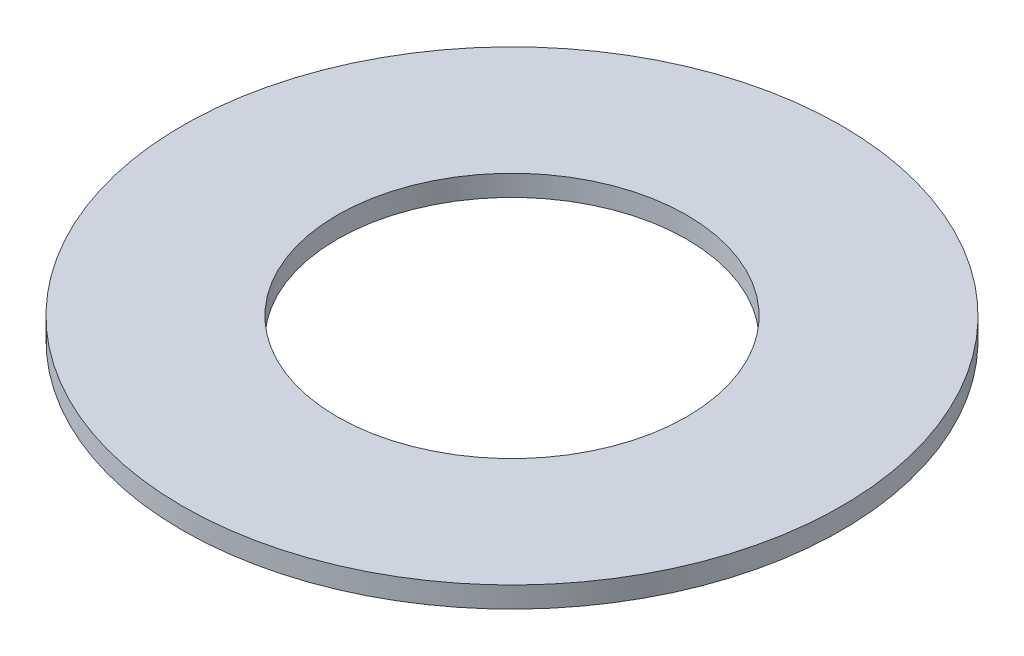
ISO-10303-21;
HEADER;
FILE_DESCRIPTION(('STEP AP214'),'2;1');
FILE_NAME('part.step','',(''),(''),'','','');
FILE_SCHEMA(('AUTOMOTIVE_DESIGN { 1 0 10303 214 1 1 1 1 }'));
ENDSEC;
DATA;
#1=APPLICATION_CONTEXT('core data for automotive mechanical design processes');
#2=APPLICATION_PROTOCOL_DEFINITION('international standard','automotive_design',2000,#1);
#3=PRODUCT_CONTEXT('',#1,'mechanical');
#4=PRODUCT('Part','Part','',(#3));
#5=PRODUCT_RELATED_PRODUCT_CATEGORY('part','',(#4));
#6=PRODUCT_DEFINITION_FORMATION('','',#4);
#7=PRODUCT_DEFINITION_CONTEXT('part definition',#1,'design');
#8=PRODUCT_DEFINITION('design','',#6,#7);
#9=PRODUCT_DEFINITION_SHAPE('','',#8);
#10=(LENGTH_UNIT() NAMED_UNIT(*) SI_UNIT(.MILLI.,.METRE.));
#11=(NAMED_UNIT(*) PLANE_ANGLE_UNIT() SI_UNIT($,.RADIAN.));
#12=(NAMED_UNIT(*) SI_UNIT($,.STERADIAN.) SOLID_ANGLE_UNIT());
#13=UNCERTAINTY_MEASURE_WITH_UNIT(LENGTH_MEASURE(1.E-05),#10,'distance_accuracy_value','');
#14=(GEOMETRIC_REPRESENTATION_CONTEXT(3) GLOBAL_UNCERTAINTY_ASSIGNED_CONTEXT((#13)) GLOBAL_UNIT_ASSIGNED_CONTEXT((#10,
#11,#12)) REPRESENTATION_CONTEXT('',''));
#15=CARTESIAN_POINT('',(0.,0.,0.));
#16=DIRECTION('',(0.,0.,1.));
#17=DIRECTION('',(1.,0.,0.));
#18=AXIS2_PLACEMENT_3D('',#15,#16,#17);
#19=CARTESIAN_POINT('',(0.,0.254,0.));
#20=DIRECTION('',(0.,1.,0.));
#21=DIRECTION('',(0.,0.,1.));
#22=AXIS2_PLACEMENT_3D('',#19,#20,#21);
#23=PLANE('',#22);
#24=CARTESIAN_POINT('',(0.,0.254,0.));
#25=DIRECTION('',(0.,1.,0.));
#26=DIRECTION('',(0.,0.,1.));
#27=AXIS2_PLACEMENT_3D('',#24,#25,#26);
#28=CIRCLE('',#27,4.);
#29=CARTESIAN_POINT('',(0.,0.254,4.));
#30=VERTEX_POINT('',#29);
#31=EDGE_CURVE('E10',#30,#30,#28,.T.);
#32=ORIENTED_EDGE('',*,*,#31,.T.);
#33=EDGE_LOOP('',(#32));
#34=FACE_BOUND('',#33,.T.);
#35=CARTESIAN_POINT('',(0.,0.254,0.));
#36=DIRECTION('',(0.,1.,0.));
#37=DIRECTION('',(0.,0.,1.));
#38=AXIS2_PLACEMENT_3D('',#35,#36,#37);
#39=CIRCLE('',#38,2.1209);
#40=CARTESIAN_POINT('',(0.,0.254,2.1209));
#41=VERTEX_POINT('',#40);
#42=EDGE_CURVE('E26',#41,#41,#39,.T.);
#43=ORIENTED_EDGE('',*,*,#42,.F.);
#44=EDGE_LOOP('',(#43));
#45=FACE_BOUND('',#44,.T.);
#46=ADVANCED_FACE('F15',(#34,#45),#23,.T.);
#47=CARTESIAN_POINT('',(0.,0.,0.));
#48=DIRECTION('',(0.,1.,0.));
#49=DIRECTION('',(0.,0.,1.));
#50=AXIS2_PLACEMENT_3D('',#47,#48,#49);
#51=PLANE('',#50);
#52=CARTESIAN_POINT('',(0.,0.,0.));
#53=DIRECTION('',(0.,1.,0.));
#54=DIRECTION('',(0.,0.,1.));
#55=AXIS2_PLACEMENT_3D('',#52,#53,#54);
#56=CIRCLE('',#55,4.);
#57=CARTESIAN_POINT('',(0.,0.,4.));
#58=VERTEX_POINT('',#57);
#59=EDGE_CURVE('E19',#58,#58,#56,.T.);
#60=ORIENTED_EDGE('',*,*,#59,.F.);
#61=EDGE_LOOP('',(#60));
#62=FACE_BOUND('',#61,.T.);
#63=CARTESIAN_POINT('',(0.,0.,0.));
#64=DIRECTION('',(0.,1.,0.));
#65=DIRECTION('',(0.,0.,1.));
#66=AXIS2_PLACEMENT_3D('',#63,#64,#65);
#67=CIRCLE('',#66,2.1209);
#68=CARTESIAN_POINT('',(0.,0.,2.1209));
#69=VERTEX_POINT('',#68);
#70=EDGE_CURVE('E28',#69,#69,#67,.T.);
#71=ORIENTED_EDGE('',*,*,#70,.T.);
#72=EDGE_LOOP('',(#71));
#73=FACE_BOUND('',#72,.T.);
#74=ADVANCED_FACE('F38',(#62,#73),#51,.F.);
#75=CARTESIAN_POINT('',(0.,0.254,0.));
#76=DIRECTION('',(0.,-1.,0.));
#77=DIRECTION('',(0.,0.,-1.));
#78=AXIS2_PLACEMENT_3D('',#75,#76,#77);
#79=CYLINDRICAL_SURFACE('',#78,4.);
#80=ORIENTED_EDGE('',*,*,#31,.F.);
#81=EDGE_LOOP('',(#80));
#82=FACE_BOUND('',#81,.T.);
#83=ORIENTED_EDGE('',*,*,#59,.T.);
#84=EDGE_LOOP('',(#83));
#85=FACE_BOUND('',#84,.T.);
#86=ADVANCED_FACE('F17',(#82,#85),#79,.T.);
#87=CARTESIAN_POINT('',(0.,0.254,0.));
#88=DIRECTION('',(0.,-1.,0.));
#89=DIRECTION('',(0.,0.,-1.));
#90=AXIS2_PLACEMENT_3D('',#87,#88,#89);
#91=CYLINDRICAL_SURFACE('',#90,2.1209);
#92=ORIENTED_EDGE('',*,*,#42,.T.);
#93=EDGE_LOOP('',(#92));
#94=FACE_BOUND('',#93,.T.);
#95=ORIENTED_EDGE('',*,*,#70,.F.);
#96=EDGE_LOOP('',(#95));
#97=FACE_BOUND('',#96,.T.);
#98=ADVANCED_FACE('F34',(#94,#97),#91,.F.);
#99=CLOSED_SHELL('',(#46,#74,#86,#98));
#100=MANIFOLD_SOLID_BREP('B1',#99);
#101=ADVANCED_BREP_SHAPE_REPRESENTATION('',(#18,#100),#14);
#102=SHAPE_DEFINITION_REPRESENTATION(#9,#101);
ENDSEC;
END-ISO-10303-21;
